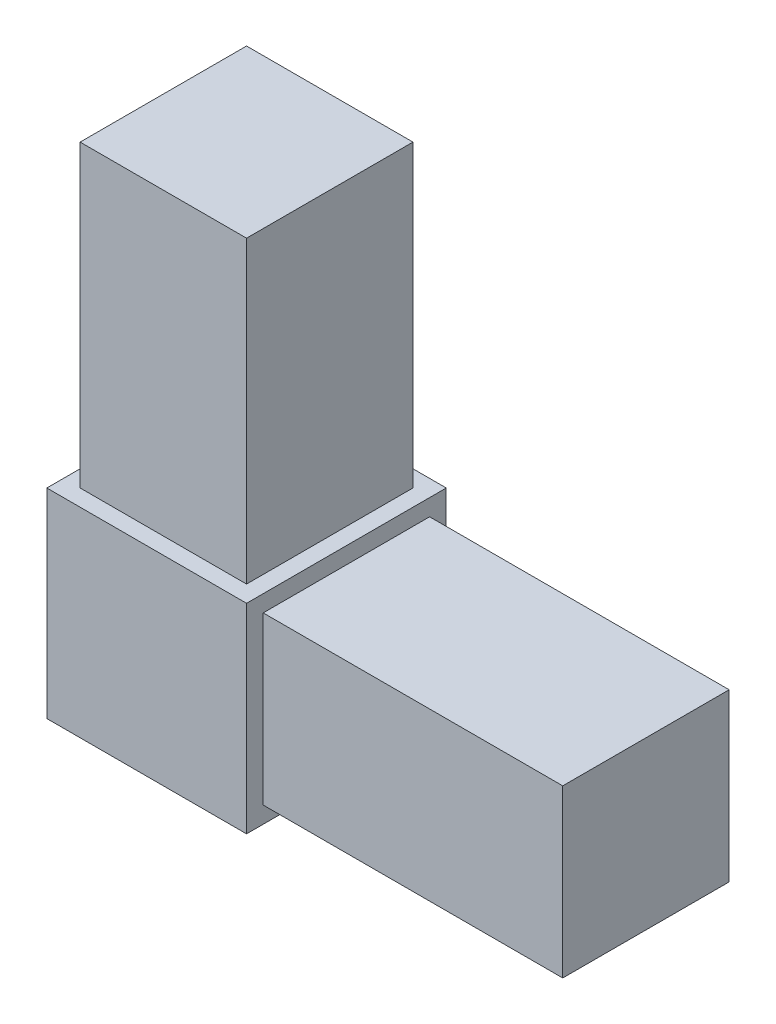
ISO-10303-21;
HEADER;
FILE_DESCRIPTION(('STEP AP214'),'2;1');
FILE_NAME('part.step','',(''),(''),'','','');
FILE_SCHEMA(('AUTOMOTIVE_DESIGN { 1 0 10303 214 1 1 1 1 }'));
ENDSEC;
DATA;
#1=APPLICATION_CONTEXT('core data for automotive mechanical design processes');
#2=APPLICATION_PROTOCOL_DEFINITION('international standard','automotive_design',2000,#1);
#3=PRODUCT_CONTEXT('',#1,'mechanical');
#4=PRODUCT('Part','Part','',(#3));
#5=PRODUCT_RELATED_PRODUCT_CATEGORY('part','',(#4));
#6=PRODUCT_DEFINITION_FORMATION('','',#4);
#7=PRODUCT_DEFINITION_CONTEXT('part definition',#1,'design');
#8=PRODUCT_DEFINITION('design','',#6,#7);
#9=PRODUCT_DEFINITION_SHAPE('','',#8);
#10=(LENGTH_UNIT() NAMED_UNIT(*) SI_UNIT(.MILLI.,.METRE.));
#11=(NAMED_UNIT(*) PLANE_ANGLE_UNIT() SI_UNIT($,.RADIAN.));
#12=(NAMED_UNIT(*) SI_UNIT($,.STERADIAN.) SOLID_ANGLE_UNIT());
#13=UNCERTAINTY_MEASURE_WITH_UNIT(LENGTH_MEASURE(1.E-05),#10,'distance_accuracy_value','');
#14=(GEOMETRIC_REPRESENTATION_CONTEXT(3) GLOBAL_UNCERTAINTY_ASSIGNED_CONTEXT((#13)) GLOBAL_UNIT_ASSIGNED_CONTEXT((#10,
#11,#12)) REPRESENTATION_CONTEXT('',''));
#15=CARTESIAN_POINT('',(0.,0.,0.));
#16=DIRECTION('',(0.,0.,1.));
#17=DIRECTION('',(1.,0.,0.));
#18=AXIS2_PLACEMENT_3D('',#15,#16,#17);
#19=CARTESIAN_POINT('',(9.525,-9.525,19.05));
#20=DIRECTION('',(-1.,0.,0.));
#21=DIRECTION('',(0.,0.,1.));
#22=AXIS2_PLACEMENT_3D('',#19,#20,#21);
#23=PLANE('',#22);
#24=DIRECTION('',(0.,1.,0.));
#25=VECTOR('',#24,1.);
#26=CARTESIAN_POINT('',(9.525,-9.525,0.));
#27=LINE('',#26,#25);
#28=CARTESIAN_POINT('',(9.525,-9.525,0.));
#29=VERTEX_POINT('',#28);
#30=CARTESIAN_POINT('',(9.525,9.525,0.));
#31=VERTEX_POINT('',#30);
#32=EDGE_CURVE('E197',#29,#31,#27,.T.);
#33=ORIENTED_EDGE('',*,*,#32,.T.);
#34=DIRECTION('',(0.,0.,-1.));
#35=VECTOR('',#34,1.);
#36=CARTESIAN_POINT('',(9.525,9.525,19.05));
#37=LINE('',#36,#35);
#38=CARTESIAN_POINT('',(9.525,9.525,19.05));
#39=VERTEX_POINT('',#38);
#40=EDGE_CURVE('E202',#39,#31,#37,.T.);
#41=ORIENTED_EDGE('',*,*,#40,.F.);
#42=DIRECTION('',(0.,1.,0.));
#43=VECTOR('',#42,1.);
#44=CARTESIAN_POINT('',(9.525,-9.525,19.05));
#45=LINE('',#44,#43);
#46=CARTESIAN_POINT('',(9.525,-9.525,19.05));
#47=VERTEX_POINT('',#46);
#48=EDGE_CURVE('E188',#47,#39,#45,.T.);
#49=ORIENTED_EDGE('',*,*,#48,.F.);
#50=DIRECTION('',(0.,0.,-1.));
#51=VECTOR('',#50,1.);
#52=CARTESIAN_POINT('',(9.525,-9.525,19.05));
#53=LINE('',#52,#51);
#54=EDGE_CURVE('E41',#47,#29,#53,.T.);
#55=ORIENTED_EDGE('',*,*,#54,.T.);
#56=EDGE_LOOP('',(#33,#41,#49,#55));
#57=FACE_BOUND('',#56,.T.);
#58=DIRECTION('',(0.,1.,0.));
#59=VECTOR('',#58,1.);
#60=CARTESIAN_POINT('',(9.525,-7.9375,1.5875));
#61=LINE('',#60,#59);
#62=CARTESIAN_POINT('',(9.525,-7.9375,1.5875));
#63=VERTEX_POINT('',#62);
#64=CARTESIAN_POINT('',(9.525,7.9375,1.5875));
#65=VERTEX_POINT('',#64);
#66=EDGE_CURVE('E142',#63,#65,#61,.T.);
#67=ORIENTED_EDGE('',*,*,#66,.F.);
#68=DIRECTION('',(0.,0.,-1.));
#69=VECTOR('',#68,1.);
#70=CARTESIAN_POINT('',(9.525,-7.9375,17.4625));
#71=LINE('',#70,#69);
#72=CARTESIAN_POINT('',(9.525,-7.9375,17.4625));
#73=VERTEX_POINT('',#72);
#74=EDGE_CURVE('E139',#73,#63,#71,.T.);
#75=ORIENTED_EDGE('',*,*,#74,.F.);
#76=DIRECTION('',(0.,-1.,0.));
#77=VECTOR('',#76,1.);
#78=CARTESIAN_POINT('',(9.525,-7.9375,17.4625));
#79=LINE('',#78,#77);
#80=CARTESIAN_POINT('',(9.525,7.9375,17.4625));
#81=VERTEX_POINT('',#80);
#82=EDGE_CURVE('E53',#81,#73,#79,.T.);
#83=ORIENTED_EDGE('',*,*,#82,.F.);
#84=DIRECTION('',(0.,0.,1.));
#85=VECTOR('',#84,1.);
#86=CARTESIAN_POINT('',(9.525,7.9375,17.4625));
#87=LINE('',#86,#85);
#88=EDGE_CURVE('E48',#65,#81,#87,.T.);
#89=ORIENTED_EDGE('',*,*,#88,.F.);
#90=EDGE_LOOP('',(#67,#75,#83,#89));
#91=FACE_BOUND('',#90,.T.);
#92=ADVANCED_FACE('F33',(#57,#91),#23,.F.);
#93=CARTESIAN_POINT('',(9.525,9.525,19.05));
#94=DIRECTION('',(0.,-1.,0.));
#95=DIRECTION('',(1.,0.,0.));
#96=AXIS2_PLACEMENT_3D('',#93,#94,#95);
#97=PLANE('',#96);
#98=DIRECTION('',(-1.,0.,0.));
#99=VECTOR('',#98,1.);
#100=CARTESIAN_POINT('',(9.525,9.525,0.));
#101=LINE('',#100,#99);
#102=CARTESIAN_POINT('',(-9.525,9.525,0.));
#103=VERTEX_POINT('',#102);
#104=EDGE_CURVE('E186',#31,#103,#101,.T.);
#105=ORIENTED_EDGE('',*,*,#104,.T.);
#106=DIRECTION('',(0.,0.,-1.));
#107=VECTOR('',#106,1.);
#108=CARTESIAN_POINT('',(-9.525,9.525,19.05));
#109=LINE('',#108,#107);
#110=CARTESIAN_POINT('',(-9.525,9.525,19.05));
#111=VERTEX_POINT('',#110);
#112=EDGE_CURVE('E192',#111,#103,#109,.T.);
#113=ORIENTED_EDGE('',*,*,#112,.F.);
#114=DIRECTION('',(-1.,0.,0.));
#115=VECTOR('',#114,1.);
#116=CARTESIAN_POINT('',(9.525,9.525,19.05));
#117=LINE('',#116,#115);
#118=EDGE_CURVE('E190',#39,#111,#117,.T.);
#119=ORIENTED_EDGE('',*,*,#118,.F.);
#120=ORIENTED_EDGE('',*,*,#40,.T.);
#121=EDGE_LOOP('',(#105,#113,#119,#120));
#122=FACE_BOUND('',#121,.T.);
#123=DIRECTION('',(0.,0.,-1.));
#124=VECTOR('',#123,1.);
#125=CARTESIAN_POINT('',(7.9375,9.525,1.5875));
#126=LINE('',#125,#124);
#127=CARTESIAN_POINT('',(7.9375,9.525,17.4625));
#128=VERTEX_POINT('',#127);
#129=CARTESIAN_POINT('',(7.9375,9.525,1.5875));
#130=VERTEX_POINT('',#129);
#131=EDGE_CURVE('E143',#128,#130,#126,.T.);
#132=ORIENTED_EDGE('',*,*,#131,.F.);
#133=DIRECTION('',(1.,0.,0.));
#134=VECTOR('',#133,1.);
#135=CARTESIAN_POINT('',(-7.9375,9.525,17.4625));
#136=LINE('',#135,#134);
#137=CARTESIAN_POINT('',(-7.9375,9.525,17.4625));
#138=VERTEX_POINT('',#137);
#139=EDGE_CURVE('E156',#138,#128,#136,.T.);
#140=ORIENTED_EDGE('',*,*,#139,.F.);
#141=DIRECTION('',(0.,0.,1.));
#142=VECTOR('',#141,1.);
#143=CARTESIAN_POINT('',(-7.9375,9.525,1.5875));
#144=LINE('',#143,#142);
#145=CARTESIAN_POINT('',(-7.9375,9.525,1.58750000000001));
#146=VERTEX_POINT('',#145);
#147=EDGE_CURVE('E165',#146,#138,#144,.T.);
#148=ORIENTED_EDGE('',*,*,#147,.F.);
#149=DIRECTION('',(-1.,0.,0.));
#150=VECTOR('',#149,1.);
#151=CARTESIAN_POINT('',(-7.9375,9.525,1.5875));
#152=LINE('',#151,#150);
#153=EDGE_CURVE('E146',#130,#146,#152,.T.);
#154=ORIENTED_EDGE('',*,*,#153,.F.);
#155=EDGE_LOOP('',(#132,#140,#148,#154));
#156=FACE_BOUND('',#155,.T.);
#157=ADVANCED_FACE('F217',(#122,#156),#97,.F.);
#158=CARTESIAN_POINT('',(-9.525,-9.525,19.05));
#159=DIRECTION('',(1.,0.,0.));
#160=DIRECTION('',(0.,0.,-1.));
#161=AXIS2_PLACEMENT_3D('',#158,#159,#160);
#162=PLANE('',#161);
#163=DIRECTION('',(0.,-1.,0.));
#164=VECTOR('',#163,1.);
#165=CARTESIAN_POINT('',(-9.525,-9.525,0.));
#166=LINE('',#165,#164);
#167=CARTESIAN_POINT('',(-9.525,-9.525,0.));
#168=VERTEX_POINT('',#167);
#169=EDGE_CURVE('E181',#103,#168,#166,.T.);
#170=ORIENTED_EDGE('',*,*,#169,.T.);
#171=DIRECTION('',(0.,0.,-1.));
#172=VECTOR('',#171,1.);
#173=CARTESIAN_POINT('',(-9.525,-9.525,19.05));
#174=LINE('',#173,#172);
#175=CARTESIAN_POINT('',(-9.525,-9.525,19.05));
#176=VERTEX_POINT('',#175);
#177=EDGE_CURVE('E11',#176,#168,#174,.T.);
#178=ORIENTED_EDGE('',*,*,#177,.F.);
#179=DIRECTION('',(0.,-1.,0.));
#180=VECTOR('',#179,1.);
#181=CARTESIAN_POINT('',(-9.525,-9.525,19.05));
#182=LINE('',#181,#180);
#183=EDGE_CURVE('E182',#111,#176,#182,.T.);
#184=ORIENTED_EDGE('',*,*,#183,.F.);
#185=ORIENTED_EDGE('',*,*,#112,.T.);
#186=EDGE_LOOP('',(#170,#178,#184,#185));
#187=FACE_BOUND('',#186,.T.);
#188=ADVANCED_FACE('F35',(#187),#162,.F.);
#189=CARTESIAN_POINT('',(9.525,-9.525,19.05));
#190=DIRECTION('',(0.,1.,0.));
#191=DIRECTION('',(-1.,0.,0.));
#192=AXIS2_PLACEMENT_3D('',#189,#190,#191);
#193=PLANE('',#192);
#194=DIRECTION('',(1.,0.,0.));
#195=VECTOR('',#194,1.);
#196=CARTESIAN_POINT('',(9.525,-9.525,0.));
#197=LINE('',#196,#195);
#198=EDGE_CURVE('E195',#168,#29,#197,.T.);
#199=ORIENTED_EDGE('',*,*,#198,.T.);
#200=ORIENTED_EDGE('',*,*,#54,.F.);
#201=DIRECTION('',(1.,0.,0.));
#202=VECTOR('',#201,1.);
#203=CARTESIAN_POINT('',(9.525,-9.525,19.05));
#204=LINE('',#203,#202);
#205=EDGE_CURVE('E185',#176,#47,#204,.T.);
#206=ORIENTED_EDGE('',*,*,#205,.F.);
#207=ORIENTED_EDGE('',*,*,#177,.T.);
#208=EDGE_LOOP('',(#199,#200,#206,#207));
#209=FACE_BOUND('',#208,.T.);
#210=ADVANCED_FACE('F225',(#209),#193,.F.);
#211=CARTESIAN_POINT('',(0.,0.,19.05));
#212=DIRECTION('',(0.,0.,1.));
#213=DIRECTION('',(1.,0.,0.));
#214=AXIS2_PLACEMENT_3D('',#211,#212,#213);
#215=PLANE('',#214);
#216=ORIENTED_EDGE('',*,*,#183,.T.);
#217=ORIENTED_EDGE('',*,*,#205,.T.);
#218=ORIENTED_EDGE('',*,*,#48,.T.);
#219=ORIENTED_EDGE('',*,*,#118,.T.);
#220=EDGE_LOOP('',(#216,#217,#218,#219));
#221=FACE_BOUND('',#220,.T.);
#222=ADVANCED_FACE('F224',(#221),#215,.T.);
#223=CARTESIAN_POINT('',(0.,0.,0.));
#224=DIRECTION('',(0.,0.,1.));
#225=DIRECTION('',(1.,0.,0.));
#226=AXIS2_PLACEMENT_3D('',#223,#224,#225);
#227=PLANE('',#226);
#228=ORIENTED_EDGE('',*,*,#169,.F.);
#229=ORIENTED_EDGE('',*,*,#104,.F.);
#230=ORIENTED_EDGE('',*,*,#32,.F.);
#231=ORIENTED_EDGE('',*,*,#198,.F.);
#232=EDGE_LOOP('',(#228,#229,#230,#231));
#233=FACE_BOUND('',#232,.T.);
#234=ADVANCED_FACE('F214',(#233),#227,.F.);
#235=CARTESIAN_POINT('',(7.9375,38.1,1.5875));
#236=DIRECTION('',(-1.,0.,0.));
#237=DIRECTION('',(0.,0.,1.));
#238=AXIS2_PLACEMENT_3D('',#235,#236,#237);
#239=PLANE('',#238);
#240=ORIENTED_EDGE('',*,*,#131,.T.);
#241=DIRECTION('',(0.,-1.,0.));
#242=VECTOR('',#241,1.);
#243=CARTESIAN_POINT('',(7.9375,38.1,1.5875));
#244=LINE('',#243,#242);
#245=CARTESIAN_POINT('',(7.9375,38.1,1.5875));
#246=VERTEX_POINT('',#245);
#247=EDGE_CURVE('E178',#246,#130,#244,.T.);
#248=ORIENTED_EDGE('',*,*,#247,.F.);
#249=DIRECTION('',(0.,0.,-1.));
#250=VECTOR('',#249,1.);
#251=CARTESIAN_POINT('',(7.9375,38.1,1.5875));
#252=LINE('',#251,#250);
#253=CARTESIAN_POINT('',(7.9375,38.1,17.4625));
#254=VERTEX_POINT('',#253);
#255=EDGE_CURVE('E152',#254,#246,#252,.T.);
#256=ORIENTED_EDGE('',*,*,#255,.F.);
#257=DIRECTION('',(0.,-1.,0.));
#258=VECTOR('',#257,1.);
#259=CARTESIAN_POINT('',(7.9375,38.1,17.4625));
#260=LINE('',#259,#258);
#261=EDGE_CURVE('E161',#254,#128,#260,.T.);
#262=ORIENTED_EDGE('',*,*,#261,.T.);
#263=EDGE_LOOP('',(#240,#248,#256,#262));
#264=FACE_BOUND('',#263,.T.);
#265=ADVANCED_FACE('F240',(#264),#239,.F.);
#266=CARTESIAN_POINT('',(-7.9375,38.1,1.5875));
#267=DIRECTION('',(0.,0.,1.));
#268=DIRECTION('',(1.,0.,0.));
#269=AXIS2_PLACEMENT_3D('',#266,#267,#268);
#270=PLANE('',#269);
#271=ORIENTED_EDGE('',*,*,#153,.T.);
#272=DIRECTION('',(0.,-1.,0.));
#273=VECTOR('',#272,1.);
#274=CARTESIAN_POINT('',(-7.9375,38.1,1.5875));
#275=LINE('',#274,#273);
#276=CARTESIAN_POINT('',(-7.9375,38.1,1.5875));
#277=VERTEX_POINT('',#276);
#278=EDGE_CURVE('E175',#277,#146,#275,.T.);
#279=ORIENTED_EDGE('',*,*,#278,.F.);
#280=DIRECTION('',(-1.,0.,0.));
#281=VECTOR('',#280,1.);
#282=CARTESIAN_POINT('',(-7.9375,38.1,1.5875));
#283=LINE('',#282,#281);
#284=EDGE_CURVE('E155',#246,#277,#283,.T.);
#285=ORIENTED_EDGE('',*,*,#284,.F.);
#286=ORIENTED_EDGE('',*,*,#247,.T.);
#287=EDGE_LOOP('',(#271,#279,#285,#286));
#288=FACE_BOUND('',#287,.T.);
#289=ADVANCED_FACE('F244',(#288),#270,.F.);
#290=CARTESIAN_POINT('',(-7.9375,38.1,1.5875));
#291=DIRECTION('',(1.,0.,0.));
#292=DIRECTION('',(0.,0.,-1.));
#293=AXIS2_PLACEMENT_3D('',#290,#291,#292);
#294=PLANE('',#293);
#295=ORIENTED_EDGE('',*,*,#147,.T.);
#296=DIRECTION('',(0.,-1.,0.));
#297=VECTOR('',#296,1.);
#298=CARTESIAN_POINT('',(-7.9375,38.1,17.4625));
#299=LINE('',#298,#297);
#300=CARTESIAN_POINT('',(-7.9375,38.1,17.4625));
#301=VERTEX_POINT('',#300);
#302=EDGE_CURVE('E172',#301,#138,#299,.T.);
#303=ORIENTED_EDGE('',*,*,#302,.F.);
#304=DIRECTION('',(0.,0.,1.));
#305=VECTOR('',#304,1.);
#306=CARTESIAN_POINT('',(-7.9375,38.1,1.5875));
#307=LINE('',#306,#305);
#308=EDGE_CURVE('E158',#277,#301,#307,.T.);
#309=ORIENTED_EDGE('',*,*,#308,.F.);
#310=ORIENTED_EDGE('',*,*,#278,.T.);
#311=EDGE_LOOP('',(#295,#303,#309,#310));
#312=FACE_BOUND('',#311,.T.);
#313=ADVANCED_FACE('F248',(#312),#294,.F.);
#314=CARTESIAN_POINT('',(-7.9375,38.1,17.4625));
#315=DIRECTION('',(0.,0.,-1.));
#316=DIRECTION('',(-1.,0.,0.));
#317=AXIS2_PLACEMENT_3D('',#314,#315,#316);
#318=PLANE('',#317);
#319=ORIENTED_EDGE('',*,*,#139,.T.);
#320=ORIENTED_EDGE('',*,*,#261,.F.);
#321=DIRECTION('',(1.,0.,0.));
#322=VECTOR('',#321,1.);
#323=CARTESIAN_POINT('',(-7.9375,38.1,17.4625));
#324=LINE('',#323,#322);
#325=EDGE_CURVE('E160',#301,#254,#324,.T.);
#326=ORIENTED_EDGE('',*,*,#325,.F.);
#327=ORIENTED_EDGE('',*,*,#302,.T.);
#328=EDGE_LOOP('',(#319,#320,#326,#327));
#329=FACE_BOUND('',#328,.T.);
#330=ADVANCED_FACE('F252',(#329),#318,.F.);
#331=CARTESIAN_POINT('',(0.,38.1,0.));
#332=DIRECTION('',(0.,1.,0.));
#333=DIRECTION('',(0.,0.,1.));
#334=AXIS2_PLACEMENT_3D('',#331,#332,#333);
#335=PLANE('',#334);
#336=ORIENTED_EDGE('',*,*,#255,.T.);
#337=ORIENTED_EDGE('',*,*,#284,.T.);
#338=ORIENTED_EDGE('',*,*,#308,.T.);
#339=ORIENTED_EDGE('',*,*,#325,.T.);
#340=EDGE_LOOP('',(#336,#337,#338,#339));
#341=FACE_BOUND('',#340,.T.);
#342=ADVANCED_FACE('F256',(#341),#335,.T.);
#343=CARTESIAN_POINT('',(38.1,-7.9375,1.5875));
#344=DIRECTION('',(0.,0.,1.));
#345=DIRECTION('',(1.,0.,0.));
#346=AXIS2_PLACEMENT_3D('',#343,#344,#345);
#347=PLANE('',#346);
#348=ORIENTED_EDGE('',*,*,#66,.T.);
#349=DIRECTION('',(-1.,0.,0.));
#350=VECTOR('',#349,1.);
#351=CARTESIAN_POINT('',(38.1,7.9375,1.5875));
#352=LINE('',#351,#350);
#353=CARTESIAN_POINT('',(38.1,7.9375,1.5875));
#354=VERTEX_POINT('',#353);
#355=EDGE_CURVE('E123',#354,#65,#352,.T.);
#356=ORIENTED_EDGE('',*,*,#355,.F.);
#357=DIRECTION('',(0.,1.,0.));
#358=VECTOR('',#357,1.);
#359=CARTESIAN_POINT('',(38.1,-7.9375,1.5875));
#360=LINE('',#359,#358);
#361=CARTESIAN_POINT('',(38.1,-7.9375,1.5875));
#362=VERTEX_POINT('',#361);
#363=EDGE_CURVE('E130',#362,#354,#360,.T.);
#364=ORIENTED_EDGE('',*,*,#363,.F.);
#365=DIRECTION('',(-1.,0.,0.));
#366=VECTOR('',#365,1.);
#367=CARTESIAN_POINT('',(38.1,-7.9375,1.5875));
#368=LINE('',#367,#366);
#369=EDGE_CURVE('E368',#362,#63,#368,.T.);
#370=ORIENTED_EDGE('',*,*,#369,.T.);
#371=EDGE_LOOP('',(#348,#356,#364,#370));
#372=FACE_BOUND('',#371,.T.);
#373=ADVANCED_FACE('F141',(#372),#347,.F.);
#374=CARTESIAN_POINT('',(38.1,7.9375,17.4625));
#375=DIRECTION('',(0.,-1.,0.));
#376=DIRECTION('',(0.,0.,-1.));
#377=AXIS2_PLACEMENT_3D('',#374,#375,#376);
#378=PLANE('',#377);
#379=ORIENTED_EDGE('',*,*,#88,.T.);
#380=DIRECTION('',(-1.,0.,0.));
#381=VECTOR('',#380,1.);
#382=CARTESIAN_POINT('',(38.1,7.9375,17.4625));
#383=LINE('',#382,#381);
#384=CARTESIAN_POINT('',(38.1,7.9375,17.4625));
#385=VERTEX_POINT('',#384);
#386=EDGE_CURVE('E126',#385,#81,#383,.T.);
#387=ORIENTED_EDGE('',*,*,#386,.F.);
#388=DIRECTION('',(0.,0.,1.));
#389=VECTOR('',#388,1.);
#390=CARTESIAN_POINT('',(38.1,7.9375,17.4625));
#391=LINE('',#390,#389);
#392=EDGE_CURVE('E119',#354,#385,#391,.T.);
#393=ORIENTED_EDGE('',*,*,#392,.F.);
#394=ORIENTED_EDGE('',*,*,#355,.T.);
#395=EDGE_LOOP('',(#379,#387,#393,#394));
#396=FACE_BOUND('',#395,.T.);
#397=ADVANCED_FACE('F121',(#396),#378,.F.);
#398=CARTESIAN_POINT('',(38.1,-7.9375,17.4625));
#399=DIRECTION('',(0.,0.,-1.));
#400=DIRECTION('',(-1.,0.,0.));
#401=AXIS2_PLACEMENT_3D('',#398,#399,#400);
#402=PLANE('',#401);
#403=ORIENTED_EDGE('',*,*,#82,.T.);
#404=DIRECTION('',(-1.,0.,0.));
#405=VECTOR('',#404,1.);
#406=CARTESIAN_POINT('',(38.1,-7.9375,17.4625));
#407=LINE('',#406,#405);
#408=CARTESIAN_POINT('',(38.1,-7.9375,17.4625));
#409=VERTEX_POINT('',#408);
#410=EDGE_CURVE('E148',#409,#73,#407,.T.);
#411=ORIENTED_EDGE('',*,*,#410,.F.);
#412=DIRECTION('',(0.,-1.,0.));
#413=VECTOR('',#412,1.);
#414=CARTESIAN_POINT('',(38.1,-7.9375,17.4625));
#415=LINE('',#414,#413);
#416=EDGE_CURVE('E129',#385,#409,#415,.T.);
#417=ORIENTED_EDGE('',*,*,#416,.F.);
#418=ORIENTED_EDGE('',*,*,#386,.T.);
#419=EDGE_LOOP('',(#403,#411,#417,#418));
#420=FACE_BOUND('',#419,.T.);
#421=ADVANCED_FACE('F265',(#420),#402,.F.);
#422=CARTESIAN_POINT('',(38.1,-7.9375,17.4625));
#423=DIRECTION('',(0.,1.,0.));
#424=DIRECTION('',(0.,0.,1.));
#425=AXIS2_PLACEMENT_3D('',#422,#423,#424);
#426=PLANE('',#425);
#427=ORIENTED_EDGE('',*,*,#74,.T.);
#428=ORIENTED_EDGE('',*,*,#369,.F.);
#429=DIRECTION('',(0.,0.,-1.));
#430=VECTOR('',#429,1.);
#431=CARTESIAN_POINT('',(38.1,-7.9375,17.4625));
#432=LINE('',#431,#430);
#433=EDGE_CURVE('E135',#409,#362,#432,.T.);
#434=ORIENTED_EDGE('',*,*,#433,.F.);
#435=ORIENTED_EDGE('',*,*,#410,.T.);
#436=EDGE_LOOP('',(#427,#428,#434,#435));
#437=FACE_BOUND('',#436,.T.);
#438=ADVANCED_FACE('F268',(#437),#426,.F.);
#439=CARTESIAN_POINT('',(38.1,0.,0.));
#440=DIRECTION('',(-1.,0.,0.));
#441=DIRECTION('',(0.,0.,1.));
#442=AXIS2_PLACEMENT_3D('',#439,#440,#441);
#443=PLANE('',#442);
#444=ORIENTED_EDGE('',*,*,#363,.T.);
#445=ORIENTED_EDGE('',*,*,#392,.T.);
#446=ORIENTED_EDGE('',*,*,#416,.T.);
#447=ORIENTED_EDGE('',*,*,#433,.T.);
#448=EDGE_LOOP('',(#444,#445,#446,#447));
#449=FACE_BOUND('',#448,.T.);
#450=ADVANCED_FACE('F133',(#449),#443,.F.);
#451=CLOSED_SHELL('',(#92,#157,#188,#210,#222,#234,#265,#289,#313,#330,#342,#373,#397,#421,#438,#450));
#452=MANIFOLD_SOLID_BREP('B2',#451);
#453=ADVANCED_BREP_SHAPE_REPRESENTATION('',(#18,#452),#14);
#454=SHAPE_DEFINITION_REPRESENTATION(#9,#453);
ENDSEC;
END-ISO-10303-21;
